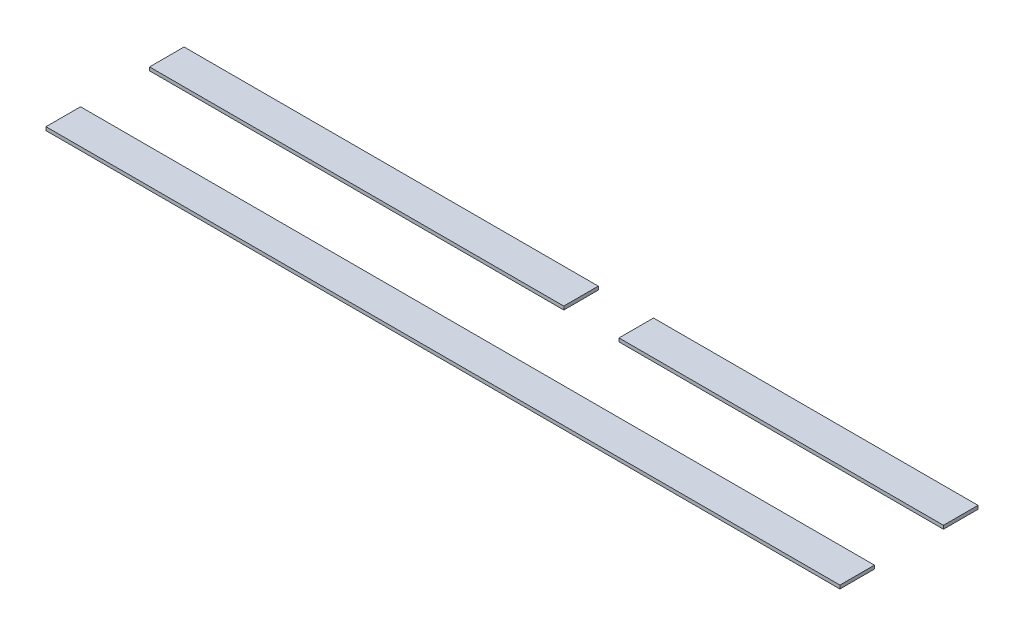
ISO-10303-21;
HEADER;
FILE_DESCRIPTION(('STEP AP214'),'2;1');
FILE_NAME('part.step','',(''),(''),'','','');
FILE_SCHEMA(('AUTOMOTIVE_DESIGN { 1 0 10303 214 1 1 1 1 }'));
ENDSEC;
DATA;
#1=APPLICATION_CONTEXT('core data for automotive mechanical design processes');
#2=APPLICATION_PROTOCOL_DEFINITION('international standard','automotive_design',2000,#1);
#3=PRODUCT_CONTEXT('',#1,'mechanical');
#4=PRODUCT('Part','Part','',(#3));
#5=PRODUCT_RELATED_PRODUCT_CATEGORY('part','',(#4));
#6=PRODUCT_DEFINITION_FORMATION('','',#4);
#7=PRODUCT_DEFINITION_CONTEXT('part definition',#1,'design');
#8=PRODUCT_DEFINITION('design','',#6,#7);
#9=PRODUCT_DEFINITION_SHAPE('','',#8);
#10=(LENGTH_UNIT() NAMED_UNIT(*) SI_UNIT(.MILLI.,.METRE.));
#11=(NAMED_UNIT(*) PLANE_ANGLE_UNIT() SI_UNIT($,.RADIAN.));
#12=(NAMED_UNIT(*) SI_UNIT($,.STERADIAN.) SOLID_ANGLE_UNIT());
#13=UNCERTAINTY_MEASURE_WITH_UNIT(LENGTH_MEASURE(1.E-05),#10,'distance_accuracy_value','');
#14=(GEOMETRIC_REPRESENTATION_CONTEXT(3) GLOBAL_UNCERTAINTY_ASSIGNED_CONTEXT((#13)) GLOBAL_UNIT_ASSIGNED_CONTEXT((#10,
#11,#12)) REPRESENTATION_CONTEXT('',''));
#15=CARTESIAN_POINT('',(0.,0.,0.));
#16=DIRECTION('',(0.,0.,1.));
#17=DIRECTION('',(1.,0.,0.));
#18=AXIS2_PLACEMENT_3D('',#15,#16,#17);
#19=CARTESIAN_POINT('',(120.,1.,-40.));
#20=DIRECTION('',(0.,0.,1.));
#21=DIRECTION('',(1.,0.,0.));
#22=AXIS2_PLACEMENT_3D('',#19,#20,#21);
#23=PLANE('',#22);
#24=DIRECTION('',(-1.,0.,0.));
#25=VECTOR('',#24,1.);
#26=CARTESIAN_POINT('',(120.,0.,-40.));
#27=LINE('',#26,#25);
#28=CARTESIAN_POINT('',(120.,0.,-40.));
#29=VERTEX_POINT('',#28);
#30=CARTESIAN_POINT('',(0.,0.,-40.));
#31=VERTEX_POINT('',#30);
#32=EDGE_CURVE('E109',#29,#31,#27,.T.);
#33=ORIENTED_EDGE('',*,*,#32,.T.);
#34=DIRECTION('',(0.,-1.,0.));
#35=VECTOR('',#34,1.);
#36=CARTESIAN_POINT('',(0.,1.,-40.));
#37=LINE('',#36,#35);
#38=CARTESIAN_POINT('',(0.,1.,-40.));
#39=VERTEX_POINT('',#38);
#40=EDGE_CURVE('E12',#39,#31,#37,.T.);
#41=ORIENTED_EDGE('',*,*,#40,.F.);
#42=DIRECTION('',(-1.,0.,0.));
#43=VECTOR('',#42,1.);
#44=CARTESIAN_POINT('',(120.,1.,-40.));
#45=LINE('',#44,#43);
#46=CARTESIAN_POINT('',(120.,1.,-40.));
#47=VERTEX_POINT('',#46);
#48=EDGE_CURVE('E97',#47,#39,#45,.T.);
#49=ORIENTED_EDGE('',*,*,#48,.F.);
#50=DIRECTION('',(0.,-1.,0.));
#51=VECTOR('',#50,1.);
#52=CARTESIAN_POINT('',(120.,1.,-40.));
#53=LINE('',#52,#51);
#54=EDGE_CURVE('E105',#47,#29,#53,.T.);
#55=ORIENTED_EDGE('',*,*,#54,.T.);
#56=EDGE_LOOP('',(#33,#41,#49,#55));
#57=FACE_BOUND('',#56,.T.);
#58=ADVANCED_FACE('F46',(#57),#23,.F.);
#59=CARTESIAN_POINT('',(0.,1.,-40.));
#60=DIRECTION('',(1.,0.,0.));
#61=DIRECTION('',(0.,0.,-1.));
#62=AXIS2_PLACEMENT_3D('',#59,#60,#61);
#63=PLANE('',#62);
#64=DIRECTION('',(0.,0.,1.));
#65=VECTOR('',#64,1.);
#66=CARTESIAN_POINT('',(0.,0.,-40.));
#67=LINE('',#66,#65);
#68=CARTESIAN_POINT('',(0.,0.,-30.));
#69=VERTEX_POINT('',#68);
#70=EDGE_CURVE('E101',#31,#69,#67,.T.);
#71=ORIENTED_EDGE('',*,*,#70,.T.);
#72=DIRECTION('',(0.,-1.,0.));
#73=VECTOR('',#72,1.);
#74=CARTESIAN_POINT('',(0.,1.,-30.));
#75=LINE('',#74,#73);
#76=CARTESIAN_POINT('',(0.,1.,-30.));
#77=VERTEX_POINT('',#76);
#78=EDGE_CURVE('E54',#77,#69,#75,.T.);
#79=ORIENTED_EDGE('',*,*,#78,.F.);
#80=DIRECTION('',(0.,0.,1.));
#81=VECTOR('',#80,1.);
#82=CARTESIAN_POINT('',(0.,1.,-40.));
#83=LINE('',#82,#81);
#84=EDGE_CURVE('E92',#39,#77,#83,.T.);
#85=ORIENTED_EDGE('',*,*,#84,.F.);
#86=ORIENTED_EDGE('',*,*,#40,.T.);
#87=EDGE_LOOP('',(#71,#79,#85,#86));
#88=FACE_BOUND('',#87,.T.);
#89=ADVANCED_FACE('F100',(#88),#63,.F.);
#90=CARTESIAN_POINT('',(120.,1.,-30.));
#91=DIRECTION('',(0.,0.,-1.));
#92=DIRECTION('',(-1.,0.,0.));
#93=AXIS2_PLACEMENT_3D('',#90,#91,#92);
#94=PLANE('',#93);
#95=DIRECTION('',(1.,0.,0.));
#96=VECTOR('',#95,1.);
#97=CARTESIAN_POINT('',(120.,0.,-30.));
#98=LINE('',#97,#96);
#99=CARTESIAN_POINT('',(120.,0.,-30.));
#100=VERTEX_POINT('',#99);
#101=EDGE_CURVE('E79',#69,#100,#98,.T.);
#102=ORIENTED_EDGE('',*,*,#101,.T.);
#103=DIRECTION('',(0.,-1.,0.));
#104=VECTOR('',#103,1.);
#105=CARTESIAN_POINT('',(120.,1.,-30.));
#106=LINE('',#105,#104);
#107=CARTESIAN_POINT('',(120.,1.,-30.));
#108=VERTEX_POINT('',#107);
#109=EDGE_CURVE('E102',#108,#100,#106,.T.);
#110=ORIENTED_EDGE('',*,*,#109,.F.);
#111=DIRECTION('',(1.,0.,0.));
#112=VECTOR('',#111,1.);
#113=CARTESIAN_POINT('',(120.,1.,-30.));
#114=LINE('',#113,#112);
#115=EDGE_CURVE('E95',#77,#108,#114,.T.);
#116=ORIENTED_EDGE('',*,*,#115,.F.);
#117=ORIENTED_EDGE('',*,*,#78,.T.);
#118=EDGE_LOOP('',(#102,#110,#116,#117));
#119=FACE_BOUND('',#118,.T.);
#120=ADVANCED_FACE('F103',(#119),#94,.F.);
#121=CARTESIAN_POINT('',(120.,1.,-30.));
#122=DIRECTION('',(-1.,0.,0.));
#123=DIRECTION('',(0.,0.,1.));
#124=AXIS2_PLACEMENT_3D('',#121,#122,#123);
#125=PLANE('',#124);
#126=DIRECTION('',(0.,0.,-1.));
#127=VECTOR('',#126,1.);
#128=CARTESIAN_POINT('',(120.,0.,-30.));
#129=LINE('',#128,#127);
#130=EDGE_CURVE('E85',#100,#29,#129,.T.);
#131=ORIENTED_EDGE('',*,*,#130,.T.);
#132=ORIENTED_EDGE('',*,*,#54,.F.);
#133=DIRECTION('',(0.,0.,-1.));
#134=VECTOR('',#133,1.);
#135=CARTESIAN_POINT('',(120.,1.,-30.));
#136=LINE('',#135,#134);
#137=EDGE_CURVE('E62',#108,#47,#136,.T.);
#138=ORIENTED_EDGE('',*,*,#137,.F.);
#139=ORIENTED_EDGE('',*,*,#109,.T.);
#140=EDGE_LOOP('',(#131,#132,#138,#139));
#141=FACE_BOUND('',#140,.T.);
#142=ADVANCED_FACE('F116',(#141),#125,.F.);
#143=CARTESIAN_POINT('',(0.,1.,0.));
#144=DIRECTION('',(0.,1.,0.));
#145=DIRECTION('',(0.,0.,1.));
#146=AXIS2_PLACEMENT_3D('',#143,#144,#145);
#147=PLANE('',#146);
#148=ORIENTED_EDGE('',*,*,#48,.T.);
#149=ORIENTED_EDGE('',*,*,#84,.T.);
#150=ORIENTED_EDGE('',*,*,#115,.T.);
#151=ORIENTED_EDGE('',*,*,#137,.T.);
#152=EDGE_LOOP('',(#148,#149,#150,#151));
#153=FACE_BOUND('',#152,.T.);
#154=ADVANCED_FACE('F93',(#153),#147,.T.);
#155=CARTESIAN_POINT('',(0.,0.,0.));
#156=DIRECTION('',(0.,1.,0.));
#157=DIRECTION('',(0.,0.,1.));
#158=AXIS2_PLACEMENT_3D('',#155,#156,#157);
#159=PLANE('',#158);
#160=ORIENTED_EDGE('',*,*,#32,.F.);
#161=ORIENTED_EDGE('',*,*,#130,.F.);
#162=ORIENTED_EDGE('',*,*,#101,.F.);
#163=ORIENTED_EDGE('',*,*,#70,.F.);
#164=EDGE_LOOP('',(#160,#161,#162,#163));
#165=FACE_BOUND('',#164,.T.);
#166=ADVANCED_FACE('F119',(#165),#159,.F.);
#167=CLOSED_SHELL('',(#58,#89,#120,#142,#154,#166));
#168=MANIFOLD_SOLID_BREP('B2',#167);
#169=CARTESIAN_POINT('',(136.,1.,-40.));
#170=DIRECTION('',(0.,0.,1.));
#171=DIRECTION('',(1.,0.,0.));
#172=AXIS2_PLACEMENT_3D('',#169,#170,#171);
#173=PLANE('',#172);
#174=DIRECTION('',(-1.,0.,0.));
#175=VECTOR('',#174,1.);
#176=CARTESIAN_POINT('',(136.,0.,-40.));
#177=LINE('',#176,#175);
#178=CARTESIAN_POINT('',(230.,0.,-40.));
#179=VERTEX_POINT('',#178);
#180=CARTESIAN_POINT('',(136.,0.,-40.));
#181=VERTEX_POINT('',#180);
#182=EDGE_CURVE('E244',#179,#181,#177,.T.);
#183=ORIENTED_EDGE('',*,*,#182,.T.);
#184=DIRECTION('',(0.,-1.,0.));
#185=VECTOR('',#184,1.);
#186=CARTESIAN_POINT('',(136.,1.,-40.));
#187=LINE('',#186,#185);
#188=CARTESIAN_POINT('',(136.,1.,-40.));
#189=VERTEX_POINT('',#188);
#190=EDGE_CURVE('E44',#189,#181,#187,.T.);
#191=ORIENTED_EDGE('',*,*,#190,.F.);
#192=DIRECTION('',(-1.,0.,0.));
#193=VECTOR('',#192,1.);
#194=CARTESIAN_POINT('',(136.,1.,-40.));
#195=LINE('',#194,#193);
#196=CARTESIAN_POINT('',(230.,1.,-40.));
#197=VERTEX_POINT('',#196);
#198=EDGE_CURVE('E232',#197,#189,#195,.T.);
#199=ORIENTED_EDGE('',*,*,#198,.F.);
#200=DIRECTION('',(0.,-1.,0.));
#201=VECTOR('',#200,1.);
#202=CARTESIAN_POINT('',(230.,1.,-40.));
#203=LINE('',#202,#201);
#204=EDGE_CURVE('E240',#197,#179,#203,.T.);
#205=ORIENTED_EDGE('',*,*,#204,.T.);
#206=EDGE_LOOP('',(#183,#191,#199,#205));
#207=FACE_BOUND('',#206,.T.);
#208=ADVANCED_FACE('F181',(#207),#173,.F.);
#209=CARTESIAN_POINT('',(136.,1.,-30.));
#210=DIRECTION('',(1.,0.,0.));
#211=DIRECTION('',(0.,0.,-1.));
#212=AXIS2_PLACEMENT_3D('',#209,#210,#211);
#213=PLANE('',#212);
#214=DIRECTION('',(0.,0.,1.));
#215=VECTOR('',#214,1.);
#216=CARTESIAN_POINT('',(136.,0.,-30.));
#217=LINE('',#216,#215);
#218=CARTESIAN_POINT('',(136.,0.,-30.));
#219=VERTEX_POINT('',#218);
#220=EDGE_CURVE('E236',#181,#219,#217,.T.);
#221=ORIENTED_EDGE('',*,*,#220,.T.);
#222=DIRECTION('',(0.,-1.,0.));
#223=VECTOR('',#222,1.);
#224=CARTESIAN_POINT('',(136.,1.,-30.));
#225=LINE('',#224,#223);
#226=CARTESIAN_POINT('',(136.,1.,-30.));
#227=VERTEX_POINT('',#226);
#228=EDGE_CURVE('E189',#227,#219,#225,.T.);
#229=ORIENTED_EDGE('',*,*,#228,.F.);
#230=DIRECTION('',(0.,0.,1.));
#231=VECTOR('',#230,1.);
#232=CARTESIAN_POINT('',(136.,1.,-30.));
#233=LINE('',#232,#231);
#234=EDGE_CURVE('E227',#189,#227,#233,.T.);
#235=ORIENTED_EDGE('',*,*,#234,.F.);
#236=ORIENTED_EDGE('',*,*,#190,.T.);
#237=EDGE_LOOP('',(#221,#229,#235,#236));
#238=FACE_BOUND('',#237,.T.);
#239=ADVANCED_FACE('F235',(#238),#213,.F.);
#240=CARTESIAN_POINT('',(230.,1.,-30.));
#241=DIRECTION('',(0.,0.,-1.));
#242=DIRECTION('',(-1.,0.,0.));
#243=AXIS2_PLACEMENT_3D('',#240,#241,#242);
#244=PLANE('',#243);
#245=DIRECTION('',(1.,0.,0.));
#246=VECTOR('',#245,1.);
#247=CARTESIAN_POINT('',(230.,0.,-30.));
#248=LINE('',#247,#246);
#249=CARTESIAN_POINT('',(230.,0.,-30.));
#250=VERTEX_POINT('',#249);
#251=EDGE_CURVE('E214',#219,#250,#248,.T.);
#252=ORIENTED_EDGE('',*,*,#251,.T.);
#253=DIRECTION('',(0.,-1.,0.));
#254=VECTOR('',#253,1.);
#255=CARTESIAN_POINT('',(230.,1.,-30.));
#256=LINE('',#255,#254);
#257=CARTESIAN_POINT('',(230.,1.,-30.));
#258=VERTEX_POINT('',#257);
#259=EDGE_CURVE('E237',#258,#250,#256,.T.);
#260=ORIENTED_EDGE('',*,*,#259,.F.);
#261=DIRECTION('',(1.,0.,0.));
#262=VECTOR('',#261,1.);
#263=CARTESIAN_POINT('',(230.,1.,-30.));
#264=LINE('',#263,#262);
#265=EDGE_CURVE('E230',#227,#258,#264,.T.);
#266=ORIENTED_EDGE('',*,*,#265,.F.);
#267=ORIENTED_EDGE('',*,*,#228,.T.);
#268=EDGE_LOOP('',(#252,#260,#266,#267));
#269=FACE_BOUND('',#268,.T.);
#270=ADVANCED_FACE('F238',(#269),#244,.F.);
#271=CARTESIAN_POINT('',(230.,1.,-40.));
#272=DIRECTION('',(-1.,0.,0.));
#273=DIRECTION('',(0.,0.,1.));
#274=AXIS2_PLACEMENT_3D('',#271,#272,#273);
#275=PLANE('',#274);
#276=DIRECTION('',(0.,0.,-1.));
#277=VECTOR('',#276,1.);
#278=CARTESIAN_POINT('',(230.,0.,-40.));
#279=LINE('',#278,#277);
#280=EDGE_CURVE('E220',#250,#179,#279,.T.);
#281=ORIENTED_EDGE('',*,*,#280,.T.);
#282=ORIENTED_EDGE('',*,*,#204,.F.);
#283=DIRECTION('',(0.,0.,-1.));
#284=VECTOR('',#283,1.);
#285=CARTESIAN_POINT('',(230.,1.,-40.));
#286=LINE('',#285,#284);
#287=EDGE_CURVE('E197',#258,#197,#286,.T.);
#288=ORIENTED_EDGE('',*,*,#287,.F.);
#289=ORIENTED_EDGE('',*,*,#259,.T.);
#290=EDGE_LOOP('',(#281,#282,#288,#289));
#291=FACE_BOUND('',#290,.T.);
#292=ADVANCED_FACE('F251',(#291),#275,.F.);
#293=CARTESIAN_POINT('',(0.,1.,0.));
#294=DIRECTION('',(0.,-1.,0.));
#295=DIRECTION('',(0.,0.,-1.));
#296=AXIS2_PLACEMENT_3D('',#293,#294,#295);
#297=PLANE('',#296);
#298=ORIENTED_EDGE('',*,*,#198,.T.);
#299=ORIENTED_EDGE('',*,*,#234,.T.);
#300=ORIENTED_EDGE('',*,*,#265,.T.);
#301=ORIENTED_EDGE('',*,*,#287,.T.);
#302=EDGE_LOOP('',(#298,#299,#300,#301));
#303=FACE_BOUND('',#302,.T.);
#304=ADVANCED_FACE('F228',(#303),#297,.F.);
#305=CARTESIAN_POINT('',(0.,0.,0.));
#306=DIRECTION('',(0.,-1.,0.));
#307=DIRECTION('',(0.,0.,-1.));
#308=AXIS2_PLACEMENT_3D('',#305,#306,#307);
#309=PLANE('',#308);
#310=ORIENTED_EDGE('',*,*,#182,.F.);
#311=ORIENTED_EDGE('',*,*,#280,.F.);
#312=ORIENTED_EDGE('',*,*,#251,.F.);
#313=ORIENTED_EDGE('',*,*,#220,.F.);
#314=EDGE_LOOP('',(#310,#311,#312,#313));
#315=FACE_BOUND('',#314,.T.);
#316=ADVANCED_FACE('F254',(#315),#309,.T.);
#317=CLOSED_SHELL('',(#208,#239,#270,#292,#304,#316));
#318=MANIFOLD_SOLID_BREP('B6',#317);
#319=CARTESIAN_POINT('',(0.,1.,0.));
#320=DIRECTION('',(1.,0.,0.));
#321=DIRECTION('',(0.,0.,-1.));
#322=AXIS2_PLACEMENT_3D('',#319,#320,#321);
#323=PLANE('',#322);
#324=DIRECTION('',(0.,0.,1.));
#325=VECTOR('',#324,1.);
#326=CARTESIAN_POINT('',(0.,0.,0.));
#327=LINE('',#326,#325);
#328=CARTESIAN_POINT('',(0.,0.,-10.));
#329=VERTEX_POINT('',#328);
#330=CARTESIAN_POINT('',(0.,0.,0.));
#331=VERTEX_POINT('',#330);
#332=EDGE_CURVE('E370',#329,#331,#327,.T.);
#333=ORIENTED_EDGE('',*,*,#332,.T.);
#334=DIRECTION('',(0.,-1.,0.));
#335=VECTOR('',#334,1.);
#336=CARTESIAN_POINT('',(0.,1.,0.));
#337=LINE('',#336,#335);
#338=CARTESIAN_POINT('',(0.,1.,0.));
#339=VERTEX_POINT('',#338);
#340=EDGE_CURVE('E179',#339,#331,#337,.T.);
#341=ORIENTED_EDGE('',*,*,#340,.F.);
#342=DIRECTION('',(0.,0.,1.));
#343=VECTOR('',#342,1.);
#344=CARTESIAN_POINT('',(0.,1.,0.));
#345=LINE('',#344,#343);
#346=CARTESIAN_POINT('',(0.,1.,-10.));
#347=VERTEX_POINT('',#346);
#348=EDGE_CURVE('E358',#347,#339,#345,.T.);
#349=ORIENTED_EDGE('',*,*,#348,.F.);
#350=DIRECTION('',(0.,-1.,0.));
#351=VECTOR('',#350,1.);
#352=CARTESIAN_POINT('',(0.,1.,-10.));
#353=LINE('',#352,#351);
#354=EDGE_CURVE('E366',#347,#329,#353,.T.);
#355=ORIENTED_EDGE('',*,*,#354,.T.);
#356=EDGE_LOOP('',(#333,#341,#349,#355));
#357=FACE_BOUND('',#356,.T.);
#358=ADVANCED_FACE('F307',(#357),#323,.F.);
#359=CARTESIAN_POINT('',(0.,1.,0.));
#360=DIRECTION('',(0.,0.,-1.));
#361=DIRECTION('',(-1.,0.,0.));
#362=AXIS2_PLACEMENT_3D('',#359,#360,#361);
#363=PLANE('',#362);
#364=DIRECTION('',(1.,0.,0.));
#365=VECTOR('',#364,1.);
#366=CARTESIAN_POINT('',(0.,0.,0.));
#367=LINE('',#366,#365);
#368=CARTESIAN_POINT('',(230.,0.,0.));
#369=VERTEX_POINT('',#368);
#370=EDGE_CURVE('E362',#331,#369,#367,.T.);
#371=ORIENTED_EDGE('',*,*,#370,.T.);
#372=DIRECTION('',(0.,-1.,0.));
#373=VECTOR('',#372,1.);
#374=CARTESIAN_POINT('',(230.,1.,0.));
#375=LINE('',#374,#373);
#376=CARTESIAN_POINT('',(230.,1.,0.));
#377=VERTEX_POINT('',#376);
#378=EDGE_CURVE('E315',#377,#369,#375,.T.);
#379=ORIENTED_EDGE('',*,*,#378,.F.);
#380=DIRECTION('',(1.,0.,0.));
#381=VECTOR('',#380,1.);
#382=CARTESIAN_POINT('',(0.,1.,0.));
#383=LINE('',#382,#381);
#384=EDGE_CURVE('E353',#339,#377,#383,.T.);
#385=ORIENTED_EDGE('',*,*,#384,.F.);
#386=ORIENTED_EDGE('',*,*,#340,.T.);
#387=EDGE_LOOP('',(#371,#379,#385,#386));
#388=FACE_BOUND('',#387,.T.);
#389=ADVANCED_FACE('F361',(#388),#363,.F.);
#390=CARTESIAN_POINT('',(230.,1.,0.));
#391=DIRECTION('',(-1.,0.,0.));
#392=DIRECTION('',(0.,0.,1.));
#393=AXIS2_PLACEMENT_3D('',#390,#391,#392);
#394=PLANE('',#393);
#395=DIRECTION('',(0.,0.,-1.));
#396=VECTOR('',#395,1.);
#397=CARTESIAN_POINT('',(230.,0.,0.));
#398=LINE('',#397,#396);
#399=CARTESIAN_POINT('',(230.,0.,-10.));
#400=VERTEX_POINT('',#399);
#401=EDGE_CURVE('E340',#369,#400,#398,.T.);
#402=ORIENTED_EDGE('',*,*,#401,.T.);
#403=DIRECTION('',(0.,-1.,0.));
#404=VECTOR('',#403,1.);
#405=CARTESIAN_POINT('',(230.,1.,-10.));
#406=LINE('',#405,#404);
#407=CARTESIAN_POINT('',(230.,1.,-10.));
#408=VERTEX_POINT('',#407);
#409=EDGE_CURVE('E363',#408,#400,#406,.T.);
#410=ORIENTED_EDGE('',*,*,#409,.F.);
#411=DIRECTION('',(0.,0.,-1.));
#412=VECTOR('',#411,1.);
#413=CARTESIAN_POINT('',(230.,1.,0.));
#414=LINE('',#413,#412);
#415=EDGE_CURVE('E356',#377,#408,#414,.T.);
#416=ORIENTED_EDGE('',*,*,#415,.F.);
#417=ORIENTED_EDGE('',*,*,#378,.T.);
#418=EDGE_LOOP('',(#402,#410,#416,#417));
#419=FACE_BOUND('',#418,.T.);
#420=ADVANCED_FACE('F364',(#419),#394,.F.);
#421=CARTESIAN_POINT('',(0.,1.,-10.));
#422=DIRECTION('',(0.,0.,1.));
#423=DIRECTION('',(1.,0.,0.));
#424=AXIS2_PLACEMENT_3D('',#421,#422,#423);
#425=PLANE('',#424);
#426=DIRECTION('',(-1.,0.,0.));
#427=VECTOR('',#426,1.);
#428=CARTESIAN_POINT('',(0.,0.,-10.));
#429=LINE('',#428,#427);
#430=EDGE_CURVE('E346',#400,#329,#429,.T.);
#431=ORIENTED_EDGE('',*,*,#430,.T.);
#432=ORIENTED_EDGE('',*,*,#354,.F.);
#433=DIRECTION('',(-1.,0.,0.));
#434=VECTOR('',#433,1.);
#435=CARTESIAN_POINT('',(0.,1.,-10.));
#436=LINE('',#435,#434);
#437=EDGE_CURVE('E323',#408,#347,#436,.T.);
#438=ORIENTED_EDGE('',*,*,#437,.F.);
#439=ORIENTED_EDGE('',*,*,#409,.T.);
#440=EDGE_LOOP('',(#431,#432,#438,#439));
#441=FACE_BOUND('',#440,.T.);
#442=ADVANCED_FACE('F377',(#441),#425,.F.);
#443=CARTESIAN_POINT('',(0.,1.,0.));
#444=DIRECTION('',(0.,-1.,0.));
#445=DIRECTION('',(0.,0.,-1.));
#446=AXIS2_PLACEMENT_3D('',#443,#444,#445);
#447=PLANE('',#446);
#448=ORIENTED_EDGE('',*,*,#348,.T.);
#449=ORIENTED_EDGE('',*,*,#384,.T.);
#450=ORIENTED_EDGE('',*,*,#415,.T.);
#451=ORIENTED_EDGE('',*,*,#437,.T.);
#452=EDGE_LOOP('',(#448,#449,#450,#451));
#453=FACE_BOUND('',#452,.T.);
#454=ADVANCED_FACE('F354',(#453),#447,.F.);
#455=CARTESIAN_POINT('',(0.,0.,0.));
#456=DIRECTION('',(0.,-1.,0.));
#457=DIRECTION('',(0.,0.,-1.));
#458=AXIS2_PLACEMENT_3D('',#455,#456,#457);
#459=PLANE('',#458);
#460=ORIENTED_EDGE('',*,*,#332,.F.);
#461=ORIENTED_EDGE('',*,*,#430,.F.);
#462=ORIENTED_EDGE('',*,*,#401,.F.);
#463=ORIENTED_EDGE('',*,*,#370,.F.);
#464=EDGE_LOOP('',(#460,#461,#462,#463));
#465=FACE_BOUND('',#464,.T.);
#466=ADVANCED_FACE('F380',(#465),#459,.T.);
#467=CLOSED_SHELL('',(#358,#389,#420,#442,#454,#466));
#468=MANIFOLD_SOLID_BREP('B38',#467);
#469=ADVANCED_BREP_SHAPE_REPRESENTATION('',(#18,#168,#318,#468),#14);
#470=SHAPE_DEFINITION_REPRESENTATION(#9,#469);
ENDSEC;
END-ISO-10303-21;
